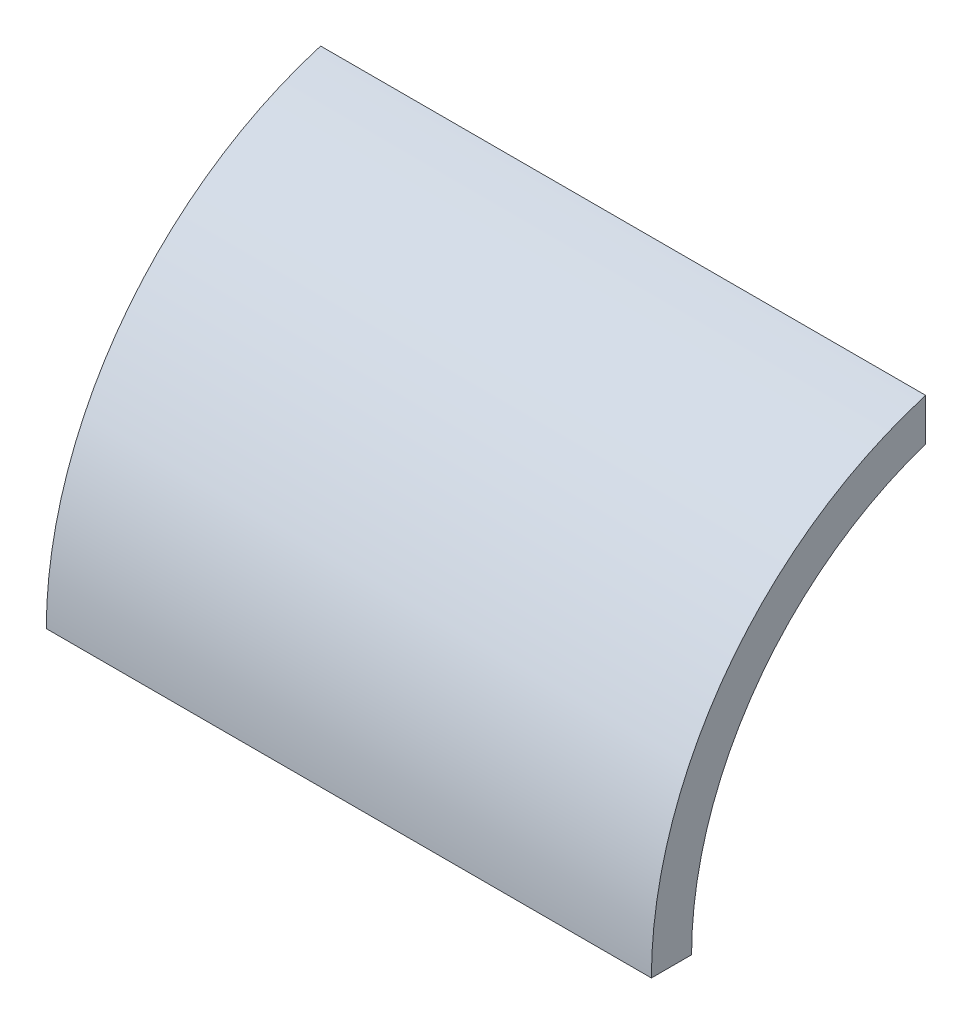
ISO-10303-21;
HEADER;
FILE_DESCRIPTION(('STEP AP214'),'2;1');
FILE_NAME('part.step','',(''),(''),'','','');
FILE_SCHEMA(('AUTOMOTIVE_DESIGN { 1 0 10303 214 1 1 1 1 }'));
ENDSEC;
DATA;
#1=APPLICATION_CONTEXT('core data for automotive mechanical design processes');
#2=APPLICATION_PROTOCOL_DEFINITION('international standard','automotive_design',2000,#1);
#3=PRODUCT_CONTEXT('',#1,'mechanical');
#4=PRODUCT('Part','Part','',(#3));
#5=PRODUCT_RELATED_PRODUCT_CATEGORY('part','',(#4));
#6=PRODUCT_DEFINITION_FORMATION('','',#4);
#7=PRODUCT_DEFINITION_CONTEXT('part definition',#1,'design');
#8=PRODUCT_DEFINITION('design','',#6,#7);
#9=PRODUCT_DEFINITION_SHAPE('','',#8);
#10=(LENGTH_UNIT() NAMED_UNIT(*) SI_UNIT(.MILLI.,.METRE.));
#11=(NAMED_UNIT(*) PLANE_ANGLE_UNIT() SI_UNIT($,.RADIAN.));
#12=(NAMED_UNIT(*) SI_UNIT($,.STERADIAN.) SOLID_ANGLE_UNIT());
#13=UNCERTAINTY_MEASURE_WITH_UNIT(LENGTH_MEASURE(1.E-05),#10,'distance_accuracy_value','');
#14=(GEOMETRIC_REPRESENTATION_CONTEXT(3) GLOBAL_UNCERTAINTY_ASSIGNED_CONTEXT((#13)) GLOBAL_UNIT_ASSIGNED_CONTEXT((#10,
#11,#12)) REPRESENTATION_CONTEXT('',''));
#15=CARTESIAN_POINT('',(0.,0.,0.));
#16=DIRECTION('',(0.,0.,1.));
#17=DIRECTION('',(1.,0.,0.));
#18=AXIS2_PLACEMENT_3D('',#15,#16,#17);
#19=CARTESIAN_POINT('',(101.6,0.,0.));
#20=DIRECTION('',(-1.,0.,0.));
#21=DIRECTION('',(0.,0.,1.));
#22=AXIS2_PLACEMENT_3D('',#19,#20,#21);
#23=CYLINDRICAL_SURFACE('',#22,57.6072);
#24=CARTESIAN_POINT('',(0.,0.,0.));
#25=DIRECTION('',(-1.,0.,0.));
#26=DIRECTION('',(0.,0.,-1.));
#27=AXIS2_PLACEMENT_3D('',#24,#25,#26);
#28=CIRCLE('',#27,57.6072);
#29=CARTESIAN_POINT('',(0.,0.,57.6072));
#30=VERTEX_POINT('',#29);
#31=CARTESIAN_POINT('',(0.,54.6245589414036,18.2960939081849));
#32=VERTEX_POINT('',#31);
#33=EDGE_CURVE('E113',#30,#32,#28,.T.);
#34=ORIENTED_EDGE('',*,*,#33,.T.);
#35=DIRECTION('',(-1.,0.,0.));
#36=VECTOR('',#35,1.);
#37=CARTESIAN_POINT('',(101.6,54.6245589414036,18.2960939081849));
#38=LINE('',#37,#36);
#39=CARTESIAN_POINT('',(101.6,54.6245589414036,18.2960939081849));
#40=VERTEX_POINT('',#39);
#41=EDGE_CURVE('E11',#40,#32,#38,.T.);
#42=ORIENTED_EDGE('',*,*,#41,.F.);
#43=CARTESIAN_POINT('',(101.6,0.,0.));
#44=DIRECTION('',(-1.,0.,0.));
#45=DIRECTION('',(0.,0.,-1.));
#46=AXIS2_PLACEMENT_3D('',#43,#44,#45);
#47=CIRCLE('',#46,57.6072);
#48=CARTESIAN_POINT('',(101.6,0.,57.6072));
#49=VERTEX_POINT('',#48);
#50=EDGE_CURVE('E97',#49,#40,#47,.T.);
#51=ORIENTED_EDGE('',*,*,#50,.F.);
#52=DIRECTION('',(-1.,0.,0.));
#53=VECTOR('',#52,1.);
#54=CARTESIAN_POINT('',(101.6,0.,57.6072));
#55=LINE('',#54,#53);
#56=EDGE_CURVE('E109',#49,#30,#55,.T.);
#57=ORIENTED_EDGE('',*,*,#56,.T.);
#58=EDGE_LOOP('',(#34,#42,#51,#57));
#59=FACE_BOUND('',#58,.T.);
#60=ADVANCED_FACE('F45',(#59),#23,.F.);
#61=CARTESIAN_POINT('',(101.6,54.6245589414036,18.2960939081849));
#62=DIRECTION('',(0.,0.,1.));
#63=DIRECTION('',(1.,0.,0.));
#64=AXIS2_PLACEMENT_3D('',#61,#62,#63);
#65=PLANE('',#64);
#66=DIRECTION('',(0.,1.,0.));
#67=VECTOR('',#66,1.);
#68=CARTESIAN_POINT('',(0.,54.6245589414036,18.2960939081849));
#69=LINE('',#68,#67);
#70=CARTESIAN_POINT('',(0.,61.6984595983441,18.2960939081849));
#71=VERTEX_POINT('',#70);
#72=EDGE_CURVE('E102',#32,#71,#69,.T.);
#73=ORIENTED_EDGE('',*,*,#72,.T.);
#74=DIRECTION('',(-1.,0.,0.));
#75=VECTOR('',#74,1.);
#76=CARTESIAN_POINT('',(101.6,61.6984595983441,18.2960939081849));
#77=LINE('',#76,#75);
#78=CARTESIAN_POINT('',(101.6,61.6984595983441,18.2960939081849));
#79=VERTEX_POINT('',#78);
#80=EDGE_CURVE('E54',#79,#71,#77,.T.);
#81=ORIENTED_EDGE('',*,*,#80,.F.);
#82=DIRECTION('',(0.,1.,0.));
#83=VECTOR('',#82,1.);
#84=CARTESIAN_POINT('',(101.6,54.6245589414036,18.2960939081849));
#85=LINE('',#84,#83);
#86=EDGE_CURVE('E92',#40,#79,#85,.T.);
#87=ORIENTED_EDGE('',*,*,#86,.F.);
#88=ORIENTED_EDGE('',*,*,#41,.T.);
#89=EDGE_LOOP('',(#73,#81,#87,#88));
#90=FACE_BOUND('',#89,.T.);
#91=ADVANCED_FACE('F101',(#90),#65,.F.);
#92=CARTESIAN_POINT('',(101.6,0.,0.));
#93=DIRECTION('',(-1.,0.,0.));
#94=DIRECTION('',(0.,0.,1.));
#95=AXIS2_PLACEMENT_3D('',#92,#93,#94);
#96=CYLINDRICAL_SURFACE('',#95,64.354075);
#97=CARTESIAN_POINT('',(0.,0.,0.));
#98=DIRECTION('',(1.,0.,0.));
#99=DIRECTION('',(0.,0.,1.));
#100=AXIS2_PLACEMENT_3D('',#97,#98,#99);
#101=CIRCLE('',#100,64.354075);
#102=CARTESIAN_POINT('',(0.,0.,64.354075));
#103=VERTEX_POINT('',#102);
#104=EDGE_CURVE('E79',#71,#103,#101,.T.);
#105=ORIENTED_EDGE('',*,*,#104,.T.);
#106=DIRECTION('',(-1.,0.,0.));
#107=VECTOR('',#106,1.);
#108=CARTESIAN_POINT('',(101.6,0.,64.354075));
#109=LINE('',#108,#107);
#110=CARTESIAN_POINT('',(101.6,0.,64.354075));
#111=VERTEX_POINT('',#110);
#112=EDGE_CURVE('E104',#111,#103,#109,.T.);
#113=ORIENTED_EDGE('',*,*,#112,.F.);
#114=CARTESIAN_POINT('',(101.6,0.,0.));
#115=DIRECTION('',(1.,0.,0.));
#116=DIRECTION('',(0.,0.,1.));
#117=AXIS2_PLACEMENT_3D('',#114,#115,#116);
#118=CIRCLE('',#117,64.354075);
#119=EDGE_CURVE('E95',#79,#111,#118,.T.);
#120=ORIENTED_EDGE('',*,*,#119,.F.);
#121=ORIENTED_EDGE('',*,*,#80,.T.);
#122=EDGE_LOOP('',(#105,#113,#120,#121));
#123=FACE_BOUND('',#122,.T.);
#124=ADVANCED_FACE('F105',(#123),#96,.T.);
#125=CARTESIAN_POINT('',(101.6,0.,57.6072));
#126=DIRECTION('',(0.,1.,0.));
#127=DIRECTION('',(0.,0.,1.));
#128=AXIS2_PLACEMENT_3D('',#125,#126,#127);
#129=PLANE('',#128);
#130=DIRECTION('',(0.,0.,-1.));
#131=VECTOR('',#130,1.);
#132=CARTESIAN_POINT('',(0.,0.,57.6072));
#133=LINE('',#132,#131);
#134=EDGE_CURVE('E85',#103,#30,#133,.T.);
#135=ORIENTED_EDGE('',*,*,#134,.T.);
#136=ORIENTED_EDGE('',*,*,#56,.F.);
#137=DIRECTION('',(0.,0.,-1.));
#138=VECTOR('',#137,1.);
#139=CARTESIAN_POINT('',(101.6,0.,57.6072));
#140=LINE('',#139,#138);
#141=EDGE_CURVE('E62',#111,#49,#140,.T.);
#142=ORIENTED_EDGE('',*,*,#141,.F.);
#143=ORIENTED_EDGE('',*,*,#112,.T.);
#144=EDGE_LOOP('',(#135,#136,#142,#143));
#145=FACE_BOUND('',#144,.T.);
#146=ADVANCED_FACE('F126',(#145),#129,.F.);
#147=CARTESIAN_POINT('',(101.6,0.,0.));
#148=DIRECTION('',(1.,0.,0.));
#149=DIRECTION('',(0.,0.,-1.));
#150=AXIS2_PLACEMENT_3D('',#147,#148,#149);
#151=PLANE('',#150);
#152=ORIENTED_EDGE('',*,*,#50,.T.);
#153=ORIENTED_EDGE('',*,*,#86,.T.);
#154=ORIENTED_EDGE('',*,*,#119,.T.);
#155=ORIENTED_EDGE('',*,*,#141,.T.);
#156=EDGE_LOOP('',(#152,#153,#154,#155));
#157=FACE_BOUND('',#156,.T.);
#158=ADVANCED_FACE('F93',(#157),#151,.T.);
#159=CARTESIAN_POINT('',(0.,0.,0.));
#160=DIRECTION('',(1.,0.,0.));
#161=DIRECTION('',(0.,0.,-1.));
#162=AXIS2_PLACEMENT_3D('',#159,#160,#161);
#163=PLANE('',#162);
#164=ORIENTED_EDGE('',*,*,#33,.F.);
#165=ORIENTED_EDGE('',*,*,#134,.F.);
#166=ORIENTED_EDGE('',*,*,#104,.F.);
#167=ORIENTED_EDGE('',*,*,#72,.F.);
#168=EDGE_LOOP('',(#164,#165,#166,#167));
#169=FACE_BOUND('',#168,.T.);
#170=ADVANCED_FACE('F129',(#169),#163,.F.);
#171=CLOSED_SHELL('',(#60,#91,#124,#146,#158,#170));
#172=MANIFOLD_SOLID_BREP('B2',#171);
#173=ADVANCED_BREP_SHAPE_REPRESENTATION('',(#18,#172),#14);
#174=SHAPE_DEFINITION_REPRESENTATION(#9,#173);
ENDSEC;
END-ISO-10303-21;
